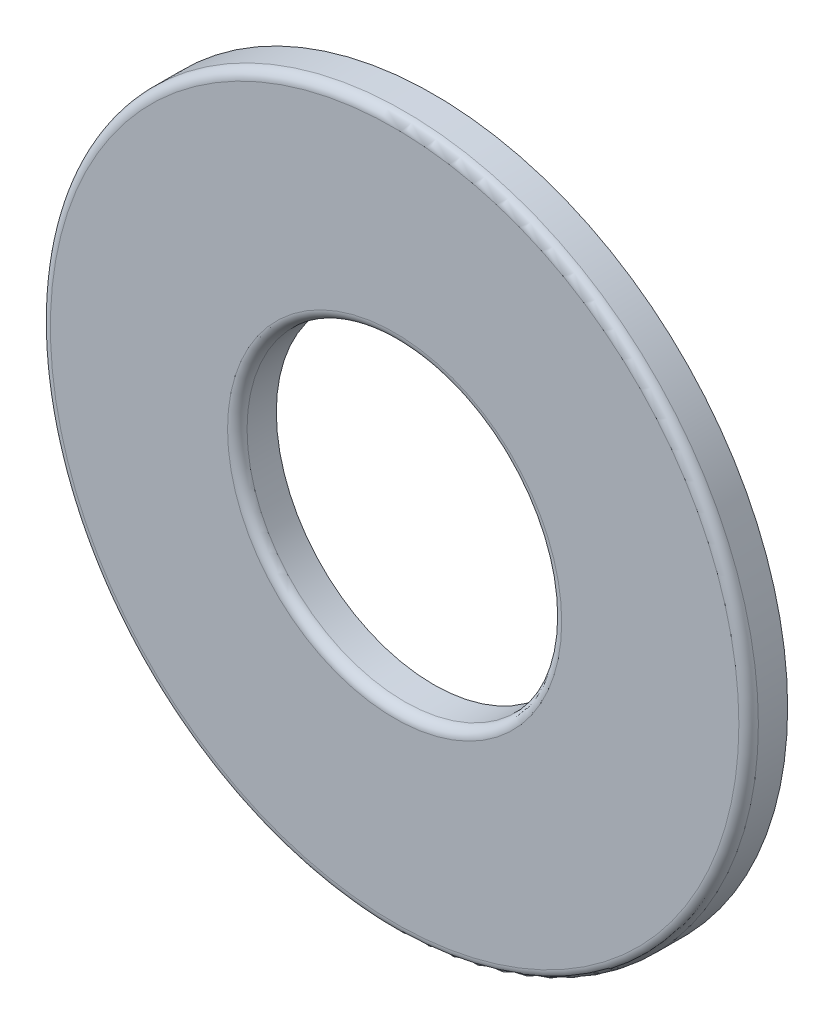
ISO-10303-21;
HEADER;
FILE_DESCRIPTION(('STEP AP214'),'2;1');
FILE_NAME('part.step','',(''),(''),'','','');
FILE_SCHEMA(('AUTOMOTIVE_DESIGN { 1 0 10303 214 1 1 1 1 }'));
ENDSEC;
DATA;
#1=APPLICATION_CONTEXT('core data for automotive mechanical design processes');
#2=APPLICATION_PROTOCOL_DEFINITION('international standard','automotive_design',2000,#1);
#3=PRODUCT_CONTEXT('',#1,'mechanical');
#4=PRODUCT('Part','Part','',(#3));
#5=PRODUCT_RELATED_PRODUCT_CATEGORY('part','',(#4));
#6=PRODUCT_DEFINITION_FORMATION('','',#4);
#7=PRODUCT_DEFINITION_CONTEXT('part definition',#1,'design');
#8=PRODUCT_DEFINITION('design','',#6,#7);
#9=PRODUCT_DEFINITION_SHAPE('','',#8);
#10=(LENGTH_UNIT() NAMED_UNIT(*) SI_UNIT(.MILLI.,.METRE.));
#11=(NAMED_UNIT(*) PLANE_ANGLE_UNIT() SI_UNIT($,.RADIAN.));
#12=(NAMED_UNIT(*) SI_UNIT($,.STERADIAN.) SOLID_ANGLE_UNIT());
#13=UNCERTAINTY_MEASURE_WITH_UNIT(LENGTH_MEASURE(1.E-05),#10,'distance_accuracy_value','');
#14=(GEOMETRIC_REPRESENTATION_CONTEXT(3) GLOBAL_UNCERTAINTY_ASSIGNED_CONTEXT((#13)) GLOBAL_UNIT_ASSIGNED_CONTEXT((#10,
#11,#12)) REPRESENTATION_CONTEXT('',''));
#15=CARTESIAN_POINT('',(0.,0.,0.));
#16=DIRECTION('',(0.,0.,1.));
#17=DIRECTION('',(1.,0.,0.));
#18=AXIS2_PLACEMENT_3D('',#15,#16,#17);
#19=CARTESIAN_POINT('',(0.,0.,0.787399999999999));
#20=DIRECTION('',(0.,0.,1.));
#21=DIRECTION('',(1.,0.,0.));
#22=AXIS2_PLACEMENT_3D('',#19,#20,#21);
#23=PLANE('',#22);
#24=CARTESIAN_POINT('',(0.,0.,0.787399999999999));
#25=DIRECTION('',(0.,0.,1.));
#26=DIRECTION('',(1.,0.,0.));
#27=AXIS2_PLACEMENT_3D('',#24,#25,#26);
#28=CIRCLE('',#27,13.8938);
#29=CARTESIAN_POINT('',(13.8938,0.,0.787399999999999));
#30=VERTEX_POINT('',#29);
#31=EDGE_CURVE('E50',#30,#30,#28,.T.);
#32=ORIENTED_EDGE('',*,*,#31,.T.);
#33=EDGE_LOOP('',(#32));
#34=FACE_BOUND('',#33,.T.);
#35=CARTESIAN_POINT('',(0.,0.,0.787399999999999));
#36=DIRECTION('',(0.,0.,1.));
#37=DIRECTION('',(1.,0.,0.));
#38=AXIS2_PLACEMENT_3D('',#35,#36,#37);
#39=CIRCLE('',#38,6.7437);
#40=CARTESIAN_POINT('',(6.7437,0.,0.787399999999999));
#41=VERTEX_POINT('',#40);
#42=EDGE_CURVE('E54',#41,#41,#39,.F.);
#43=ORIENTED_EDGE('',*,*,#42,.T.);
#44=EDGE_LOOP('',(#43));
#45=FACE_BOUND('',#44,.T.);
#46=ADVANCED_FACE('F39',(#34,#45),#23,.T.);
#47=CARTESIAN_POINT('',(0.,0.,0.787399999999999));
#48=DIRECTION('',(0.,0.,-1.));
#49=DIRECTION('',(-1.,0.,0.));
#50=AXIS2_PLACEMENT_3D('',#47,#48,#49);
#51=CYLINDRICAL_SURFACE('',#50,14.2875);
#52=CARTESIAN_POINT('',(0.,0.,0.393699999999999));
#53=DIRECTION('',(0.,0.,1.));
#54=DIRECTION('',(1.,0.,0.));
#55=AXIS2_PLACEMENT_3D('',#52,#53,#54);
#56=CIRCLE('',#55,14.2875);
#57=CARTESIAN_POINT('',(14.2875,0.,0.393699999999999));
#58=VERTEX_POINT('',#57);
#59=EDGE_CURVE('E46',#58,#58,#56,.F.);
#60=ORIENTED_EDGE('',*,*,#59,.T.);
#61=EDGE_LOOP('',(#60));
#62=FACE_BOUND('',#61,.T.);
#63=CARTESIAN_POINT('',(0.,0.,-0.787400000000001));
#64=DIRECTION('',(0.,0.,1.));
#65=DIRECTION('',(1.,0.,0.));
#66=AXIS2_PLACEMENT_3D('',#63,#64,#65);
#67=CIRCLE('',#66,14.2875);
#68=CARTESIAN_POINT('',(14.2875,0.,-0.787400000000001));
#69=VERTEX_POINT('',#68);
#70=EDGE_CURVE('E59',#69,#69,#67,.T.);
#71=ORIENTED_EDGE('',*,*,#70,.T.);
#72=EDGE_LOOP('',(#71));
#73=FACE_BOUND('',#72,.T.);
#74=ADVANCED_FACE('F71',(#62,#73),#51,.T.);
#75=CARTESIAN_POINT('',(0.,0.,0.787399999999999));
#76=DIRECTION('',(0.,0.,-1.));
#77=DIRECTION('',(-1.,0.,0.));
#78=AXIS2_PLACEMENT_3D('',#75,#76,#77);
#79=CYLINDRICAL_SURFACE('',#78,6.35);
#80=CARTESIAN_POINT('',(0.,0.,0.393699999999999));
#81=DIRECTION('',(0.,0.,1.));
#82=DIRECTION('',(1.,0.,0.));
#83=AXIS2_PLACEMENT_3D('',#80,#81,#82);
#84=CIRCLE('',#83,6.35);
#85=CARTESIAN_POINT('',(6.35,0.,0.393699999999999));
#86=VERTEX_POINT('',#85);
#87=EDGE_CURVE('E10',#86,#86,#84,.T.);
#88=ORIENTED_EDGE('',*,*,#87,.T.);
#89=EDGE_LOOP('',(#88));
#90=FACE_BOUND('',#89,.T.);
#91=CARTESIAN_POINT('',(0.,0.,-0.787400000000001));
#92=DIRECTION('',(0.,0.,1.));
#93=DIRECTION('',(1.,0.,0.));
#94=AXIS2_PLACEMENT_3D('',#91,#92,#93);
#95=CIRCLE('',#94,6.35);
#96=CARTESIAN_POINT('',(6.35,0.,-0.787400000000001));
#97=VERTEX_POINT('',#96);
#98=EDGE_CURVE('E62',#97,#97,#95,.T.);
#99=ORIENTED_EDGE('',*,*,#98,.F.);
#100=EDGE_LOOP('',(#99));
#101=FACE_BOUND('',#100,.T.);
#102=ADVANCED_FACE('F69',(#90,#101),#79,.F.);
#103=CARTESIAN_POINT('',(0.,0.,-0.787400000000001));
#104=DIRECTION('',(0.,0.,1.));
#105=DIRECTION('',(1.,0.,0.));
#106=AXIS2_PLACEMENT_3D('',#103,#104,#105);
#107=PLANE('',#106);
#108=ORIENTED_EDGE('',*,*,#98,.T.);
#109=EDGE_LOOP('',(#108));
#110=FACE_BOUND('',#109,.T.);
#111=ORIENTED_EDGE('',*,*,#70,.F.);
#112=EDGE_LOOP('',(#111));
#113=FACE_BOUND('',#112,.T.);
#114=ADVANCED_FACE('F66',(#110,#113),#107,.F.);
#115=CARTESIAN_POINT('',(0.,0.,0.393699999999999));
#116=DIRECTION('',(0.,0.,1.));
#117=DIRECTION('',(1.,0.,0.));
#118=AXIS2_PLACEMENT_3D('',#115,#116,#117);
#119=TOROIDAL_SURFACE('',#118,13.8938,0.3937);
#120=ORIENTED_EDGE('',*,*,#59,.F.);
#121=EDGE_LOOP('',(#120));
#122=FACE_BOUND('',#121,.T.);
#123=ORIENTED_EDGE('',*,*,#31,.F.);
#124=EDGE_LOOP('',(#123));
#125=FACE_BOUND('',#124,.T.);
#126=ADVANCED_FACE('F78',(#122,#125),#119,.T.);
#127=CARTESIAN_POINT('',(0.,0.,0.393699999999999));
#128=DIRECTION('',(0.,0.,1.));
#129=DIRECTION('',(1.,0.,0.));
#130=AXIS2_PLACEMENT_3D('',#127,#128,#129);
#131=TOROIDAL_SURFACE('',#130,6.7437,0.3937);
#132=ORIENTED_EDGE('',*,*,#42,.F.);
#133=EDGE_LOOP('',(#132));
#134=FACE_BOUND('',#133,.T.);
#135=ORIENTED_EDGE('',*,*,#87,.F.);
#136=EDGE_LOOP('',(#135));
#137=FACE_BOUND('',#136,.T.);
#138=ADVANCED_FACE('F41',(#134,#137),#131,.T.);
#139=CLOSED_SHELL('',(#46,#74,#102,#114,#126,#138));
#140=MANIFOLD_SOLID_BREP('B2',#139);
#141=ADVANCED_BREP_SHAPE_REPRESENTATION('',(#18,#140),#14);
#142=SHAPE_DEFINITION_REPRESENTATION(#9,#141);
ENDSEC;
END-ISO-10303-21;
